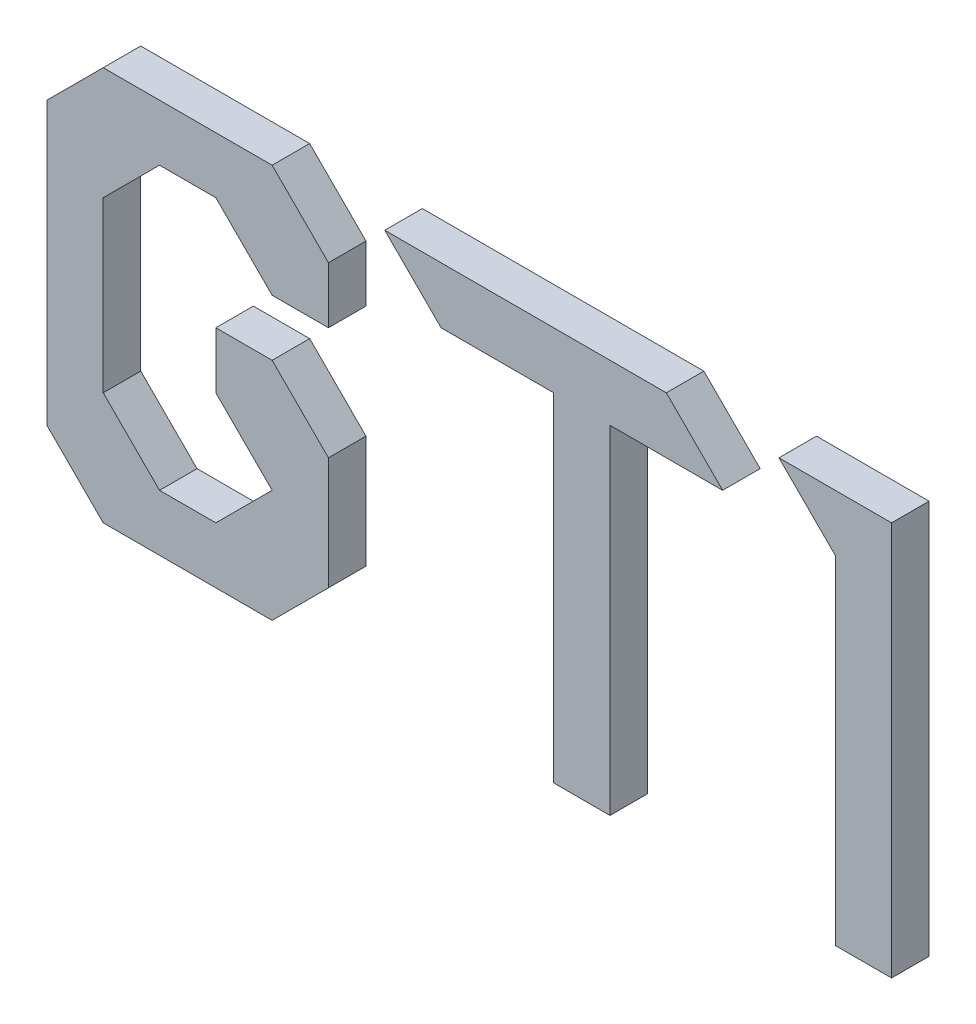
ISO-10303-21;
HEADER;
FILE_DESCRIPTION(('STEP AP214'),'2;1');
FILE_NAME('part.step','',(''),(''),'','','');
FILE_SCHEMA(('AUTOMOTIVE_DESIGN { 1 0 10303 214 1 1 1 1 }'));
ENDSEC;
DATA;
#1=APPLICATION_CONTEXT('core data for automotive mechanical design processes');
#2=APPLICATION_PROTOCOL_DEFINITION('international standard','automotive_design',2000,#1);
#3=PRODUCT_CONTEXT('',#1,'mechanical');
#4=PRODUCT('Part','Part','',(#3));
#5=PRODUCT_RELATED_PRODUCT_CATEGORY('part','',(#4));
#6=PRODUCT_DEFINITION_FORMATION('','',#4);
#7=PRODUCT_DEFINITION_CONTEXT('part definition',#1,'design');
#8=PRODUCT_DEFINITION('design','',#6,#7);
#9=PRODUCT_DEFINITION_SHAPE('','',#8);
#10=(LENGTH_UNIT() NAMED_UNIT(*) SI_UNIT(.MILLI.,.METRE.));
#11=(NAMED_UNIT(*) PLANE_ANGLE_UNIT() SI_UNIT($,.RADIAN.));
#12=(NAMED_UNIT(*) SI_UNIT($,.STERADIAN.) SOLID_ANGLE_UNIT());
#13=UNCERTAINTY_MEASURE_WITH_UNIT(LENGTH_MEASURE(1.E-05),#10,'distance_accuracy_value','');
#14=(GEOMETRIC_REPRESENTATION_CONTEXT(3) GLOBAL_UNCERTAINTY_ASSIGNED_CONTEXT((#13)) GLOBAL_UNIT_ASSIGNED_CONTEXT((#10,
#11,#12)) REPRESENTATION_CONTEXT('',''));
#15=CARTESIAN_POINT('',(0.,0.,0.));
#16=DIRECTION('',(0.,0.,1.));
#17=DIRECTION('',(1.,0.,0.));
#18=AXIS2_PLACEMENT_3D('',#15,#16,#17);
#19=CARTESIAN_POINT('',(112.5,90.,10.));
#20=DIRECTION('',(0.,-1.,0.));
#21=DIRECTION('',(0.,0.,-1.));
#22=AXIS2_PLACEMENT_3D('',#19,#20,#21);
#23=PLANE('',#22);
#24=DIRECTION('',(-1.,0.,0.));
#25=VECTOR('',#24,1.);
#26=CARTESIAN_POINT('',(112.5,90.,0.));
#27=LINE('',#26,#25);
#28=CARTESIAN_POINT('',(180.,90.,0.));
#29=VERTEX_POINT('',#28);
#30=CARTESIAN_POINT('',(150.,90.,0.));
#31=VERTEX_POINT('',#30);
#32=EDGE_CURVE('E137',#29,#31,#27,.T.);
#33=ORIENTED_EDGE('',*,*,#32,.F.);
#34=DIRECTION('',(0.,0.,-1.));
#35=VECTOR('',#34,1.);
#36=CARTESIAN_POINT('',(180.,90.,10.));
#37=LINE('',#36,#35);
#38=CARTESIAN_POINT('',(180.,90.,10.));
#39=VERTEX_POINT('',#38);
#40=EDGE_CURVE('E12',#39,#29,#37,.T.);
#41=ORIENTED_EDGE('',*,*,#40,.F.);
#42=DIRECTION('',(-1.,0.,0.));
#43=VECTOR('',#42,1.);
#44=CARTESIAN_POINT('',(112.5,90.,10.));
#45=LINE('',#44,#43);
#46=CARTESIAN_POINT('',(150.,90.,10.));
#47=VERTEX_POINT('',#46);
#48=EDGE_CURVE('E155',#39,#47,#45,.T.);
#49=ORIENTED_EDGE('',*,*,#48,.T.);
#50=DIRECTION('',(0.,0.,-1.));
#51=VECTOR('',#50,1.);
#52=CARTESIAN_POINT('',(150.,90.,10.));
#53=LINE('',#52,#51);
#54=EDGE_CURVE('E61',#47,#31,#53,.T.);
#55=ORIENTED_EDGE('',*,*,#54,.T.);
#56=EDGE_LOOP('',(#33,#41,#49,#55));
#57=FACE_BOUND('',#56,.T.);
#58=ADVANCED_FACE('F44',(#57),#23,.T.);
#59=CARTESIAN_POINT('',(261.634484941555,8.36551505844435,10.));
#60=DIRECTION('',(0.707106781186547,0.707106781186548,0.));
#61=DIRECTION('',(-0.707106781186548,0.707106781186547,0.));
#62=AXIS2_PLACEMENT_3D('',#59,#60,#61);
#63=PLANE('',#62);
#64=DIRECTION('',(0.707106781186548,-0.707106781186547,0.));
#65=VECTOR('',#64,1.);
#66=CARTESIAN_POINT('',(261.634484941555,8.36551505844435,0.));
#67=LINE('',#66,#65);
#68=CARTESIAN_POINT('',(165.,105.,0.));
#69=VERTEX_POINT('',#68);
#70=EDGE_CURVE('E139',#69,#29,#67,.T.);
#71=ORIENTED_EDGE('',*,*,#70,.F.);
#72=DIRECTION('',(0.,0.,-1.));
#73=VECTOR('',#72,1.);
#74=CARTESIAN_POINT('',(165.,105.,10.));
#75=LINE('',#74,#73);
#76=CARTESIAN_POINT('',(165.,105.,10.));
#77=VERTEX_POINT('',#76);
#78=EDGE_CURVE('E53',#77,#69,#75,.T.);
#79=ORIENTED_EDGE('',*,*,#78,.F.);
#80=DIRECTION('',(0.707106781186548,-0.707106781186547,0.));
#81=VECTOR('',#80,1.);
#82=CARTESIAN_POINT('',(261.634484941555,8.36551505844435,10.));
#83=LINE('',#82,#81);
#84=EDGE_CURVE('E182',#77,#39,#83,.T.);
#85=ORIENTED_EDGE('',*,*,#84,.T.);
#86=ORIENTED_EDGE('',*,*,#40,.T.);
#87=EDGE_LOOP('',(#71,#79,#85,#86));
#88=FACE_BOUND('',#87,.T.);
#89=ADVANCED_FACE('F46',(#88),#63,.T.);
#90=CARTESIAN_POINT('',(112.5,105.,10.));
#91=DIRECTION('',(0.,1.,0.));
#92=DIRECTION('',(0.,0.,1.));
#93=AXIS2_PLACEMENT_3D('',#90,#91,#92);
#94=PLANE('',#93);
#95=DIRECTION('',(1.,0.,0.));
#96=VECTOR('',#95,1.);
#97=CARTESIAN_POINT('',(112.5,105.,0.));
#98=LINE('',#97,#96);
#99=CARTESIAN_POINT('',(89.9999999999997,105.,0.));
#100=VERTEX_POINT('',#99);
#101=EDGE_CURVE('E143',#100,#69,#98,.T.);
#102=ORIENTED_EDGE('',*,*,#101,.F.);
#103=DIRECTION('',(0.,0.,-1.));
#104=VECTOR('',#103,1.);
#105=CARTESIAN_POINT('',(89.9999999999997,105.,10.));
#106=LINE('',#105,#104);
#107=CARTESIAN_POINT('',(89.9999999999997,105.,10.));
#108=VERTEX_POINT('',#107);
#109=EDGE_CURVE('E161',#108,#100,#106,.T.);
#110=ORIENTED_EDGE('',*,*,#109,.F.);
#111=DIRECTION('',(1.,0.,0.));
#112=VECTOR('',#111,1.);
#113=CARTESIAN_POINT('',(112.5,105.,10.));
#114=LINE('',#113,#112);
#115=EDGE_CURVE('E168',#108,#77,#114,.T.);
#116=ORIENTED_EDGE('',*,*,#115,.T.);
#117=ORIENTED_EDGE('',*,*,#78,.T.);
#118=EDGE_LOOP('',(#102,#110,#116,#117));
#119=FACE_BOUND('',#118,.T.);
#120=ADVANCED_FACE('F166',(#119),#94,.T.);
#121=CARTESIAN_POINT('',(224.134484941555,-29.1344849415553,10.));
#122=DIRECTION('',(0.707106781186546,0.707106781186549,0.));
#123=DIRECTION('',(-0.707106781186549,0.707106781186546,0.));
#124=AXIS2_PLACEMENT_3D('',#121,#122,#123);
#125=PLANE('',#124);
#126=DIRECTION('',(0.707106781186549,-0.707106781186546,0.));
#127=VECTOR('',#126,1.);
#128=CARTESIAN_POINT('',(224.134484941555,-29.1344849415553,0.));
#129=LINE('',#128,#127);
#130=CARTESIAN_POINT('',(105.,90.,0.));
#131=VERTEX_POINT('',#130);
#132=EDGE_CURVE('E146',#100,#131,#129,.T.);
#133=ORIENTED_EDGE('',*,*,#132,.T.);
#134=DIRECTION('',(0.,0.,-1.));
#135=VECTOR('',#134,1.);
#136=CARTESIAN_POINT('',(105.,90.,10.));
#137=LINE('',#136,#135);
#138=CARTESIAN_POINT('',(105.,90.,10.));
#139=VERTEX_POINT('',#138);
#140=EDGE_CURVE('E159',#139,#131,#137,.T.);
#141=ORIENTED_EDGE('',*,*,#140,.F.);
#142=DIRECTION('',(0.707106781186549,-0.707106781186546,0.));
#143=VECTOR('',#142,1.);
#144=CARTESIAN_POINT('',(224.134484941555,-29.1344849415553,10.));
#145=LINE('',#144,#143);
#146=EDGE_CURVE('E181',#108,#139,#145,.T.);
#147=ORIENTED_EDGE('',*,*,#146,.F.);
#148=ORIENTED_EDGE('',*,*,#109,.T.);
#149=EDGE_LOOP('',(#133,#141,#147,#148));
#150=FACE_BOUND('',#149,.T.);
#151=ADVANCED_FACE('F179',(#150),#125,.F.);
#152=CARTESIAN_POINT('',(135.,90.,0.));
#153=VERTEX_POINT('',#152);
#154=EDGE_CURVE('E140',#153,#131,#27,.T.);
#155=ORIENTED_EDGE('',*,*,#154,.F.);
#156=DIRECTION('',(0.,0.,-1.));
#157=VECTOR('',#156,1.);
#158=CARTESIAN_POINT('',(135.,90.,10.));
#159=LINE('',#158,#157);
#160=CARTESIAN_POINT('',(135.,90.,10.));
#161=VERTEX_POINT('',#160);
#162=EDGE_CURVE('E120',#161,#153,#159,.T.);
#163=ORIENTED_EDGE('',*,*,#162,.F.);
#164=EDGE_CURVE('E129',#161,#139,#45,.T.);
#165=ORIENTED_EDGE('',*,*,#164,.T.);
#166=ORIENTED_EDGE('',*,*,#140,.T.);
#167=EDGE_LOOP('',(#155,#163,#165,#166));
#168=FACE_BOUND('',#167,.T.);
#169=ADVANCED_FACE('F187',(#168),#23,.T.);
#170=CARTESIAN_POINT('',(135.,-140.768969883111,10.));
#171=DIRECTION('',(-1.,0.,0.));
#172=DIRECTION('',(0.,-1.,0.));
#173=AXIS2_PLACEMENT_3D('',#170,#171,#172);
#174=PLANE('',#173);
#175=DIRECTION('',(0.,1.,0.));
#176=VECTOR('',#175,1.);
#177=CARTESIAN_POINT('',(135.,-140.768969883111,0.));
#178=LINE('',#177,#176);
#179=CARTESIAN_POINT('',(135.,0.,0.));
#180=VERTEX_POINT('',#179);
#181=EDGE_CURVE('E116',#180,#153,#178,.T.);
#182=ORIENTED_EDGE('',*,*,#181,.F.);
#183=DIRECTION('',(0.,0.,-1.));
#184=VECTOR('',#183,1.);
#185=CARTESIAN_POINT('',(135.,0.,10.));
#186=LINE('',#185,#184);
#187=CARTESIAN_POINT('',(135.,0.,10.));
#188=VERTEX_POINT('',#187);
#189=EDGE_CURVE('E111',#188,#180,#186,.T.);
#190=ORIENTED_EDGE('',*,*,#189,.F.);
#191=DIRECTION('',(0.,1.,0.));
#192=VECTOR('',#191,1.);
#193=CARTESIAN_POINT('',(135.,-140.768969883111,10.));
#194=LINE('',#193,#192);
#195=EDGE_CURVE('E114',#188,#161,#194,.T.);
#196=ORIENTED_EDGE('',*,*,#195,.T.);
#197=ORIENTED_EDGE('',*,*,#162,.T.);
#198=EDGE_LOOP('',(#182,#190,#196,#197));
#199=FACE_BOUND('',#198,.T.);
#200=ADVANCED_FACE('F113',(#199),#174,.T.);
#201=CARTESIAN_POINT('',(112.5,0.,10.));
#202=DIRECTION('',(0.,-1.,0.));
#203=DIRECTION('',(0.,0.,-1.));
#204=AXIS2_PLACEMENT_3D('',#201,#202,#203);
#205=PLANE('',#204);
#206=DIRECTION('',(-1.,0.,0.));
#207=VECTOR('',#206,1.);
#208=CARTESIAN_POINT('',(112.5,0.,0.));
#209=LINE('',#208,#207);
#210=CARTESIAN_POINT('',(150.,0.,0.));
#211=VERTEX_POINT('',#210);
#212=EDGE_CURVE('E150',#211,#180,#209,.T.);
#213=ORIENTED_EDGE('',*,*,#212,.F.);
#214=DIRECTION('',(0.,0.,-1.));
#215=VECTOR('',#214,1.);
#216=CARTESIAN_POINT('',(150.,0.,10.));
#217=LINE('',#216,#215);
#218=CARTESIAN_POINT('',(150.,0.,10.));
#219=VERTEX_POINT('',#218);
#220=EDGE_CURVE('E86',#219,#211,#217,.T.);
#221=ORIENTED_EDGE('',*,*,#220,.F.);
#222=DIRECTION('',(-1.,0.,0.));
#223=VECTOR('',#222,1.);
#224=CARTESIAN_POINT('',(112.5,0.,10.));
#225=LINE('',#224,#223);
#226=EDGE_CURVE('E127',#219,#188,#225,.T.);
#227=ORIENTED_EDGE('',*,*,#226,.T.);
#228=ORIENTED_EDGE('',*,*,#189,.T.);
#229=EDGE_LOOP('',(#213,#221,#227,#228));
#230=FACE_BOUND('',#229,.T.);
#231=ADVANCED_FACE('F131',(#230),#205,.T.);
#232=CARTESIAN_POINT('',(150.,-140.768969883111,10.));
#233=DIRECTION('',(1.,0.,0.));
#234=DIRECTION('',(0.,1.,0.));
#235=AXIS2_PLACEMENT_3D('',#232,#233,#234);
#236=PLANE('',#235);
#237=DIRECTION('',(0.,-1.,0.));
#238=VECTOR('',#237,1.);
#239=CARTESIAN_POINT('',(150.,-140.768969883111,0.));
#240=LINE('',#239,#238);
#241=EDGE_CURVE('E152',#31,#211,#240,.T.);
#242=ORIENTED_EDGE('',*,*,#241,.F.);
#243=ORIENTED_EDGE('',*,*,#54,.F.);
#244=DIRECTION('',(0.,-1.,0.));
#245=VECTOR('',#244,1.);
#246=CARTESIAN_POINT('',(150.,-140.768969883111,10.));
#247=LINE('',#246,#245);
#248=EDGE_CURVE('E132',#47,#219,#247,.T.);
#249=ORIENTED_EDGE('',*,*,#248,.T.);
#250=ORIENTED_EDGE('',*,*,#220,.T.);
#251=EDGE_LOOP('',(#242,#243,#249,#250));
#252=FACE_BOUND('',#251,.T.);
#253=ADVANCED_FACE('F188',(#252),#236,.T.);
#254=CARTESIAN_POINT('',(112.5,-140.768969883111,10.));
#255=DIRECTION('',(0.,0.,1.));
#256=DIRECTION('',(1.,0.,0.));
#257=AXIS2_PLACEMENT_3D('',#254,#255,#256);
#258=PLANE('',#257);
#259=ORIENTED_EDGE('',*,*,#48,.F.);
#260=ORIENTED_EDGE('',*,*,#84,.F.);
#261=ORIENTED_EDGE('',*,*,#115,.F.);
#262=ORIENTED_EDGE('',*,*,#146,.T.);
#263=ORIENTED_EDGE('',*,*,#164,.F.);
#264=ORIENTED_EDGE('',*,*,#195,.F.);
#265=ORIENTED_EDGE('',*,*,#226,.F.);
#266=ORIENTED_EDGE('',*,*,#248,.F.);
#267=EDGE_LOOP('',(#259,#260,#261,#262,#263,#264,#265,#266));
#268=FACE_BOUND('',#267,.T.);
#269=ADVANCED_FACE('F125',(#268),#258,.T.);
#270=CARTESIAN_POINT('',(112.5,-140.768969883111,0.));
#271=DIRECTION('',(0.,0.,1.));
#272=DIRECTION('',(1.,0.,0.));
#273=AXIS2_PLACEMENT_3D('',#270,#271,#272);
#274=PLANE('',#273);
#275=ORIENTED_EDGE('',*,*,#32,.T.);
#276=ORIENTED_EDGE('',*,*,#241,.T.);
#277=ORIENTED_EDGE('',*,*,#212,.T.);
#278=ORIENTED_EDGE('',*,*,#181,.T.);
#279=ORIENTED_EDGE('',*,*,#154,.T.);
#280=ORIENTED_EDGE('',*,*,#132,.F.);
#281=ORIENTED_EDGE('',*,*,#101,.T.);
#282=ORIENTED_EDGE('',*,*,#70,.T.);
#283=EDGE_LOOP('',(#275,#276,#277,#278,#279,#280,#281,#282));
#284=FACE_BOUND('',#283,.T.);
#285=ADVANCED_FACE('F174',(#284),#274,.F.);
#286=CLOSED_SHELL('',(#58,#89,#120,#151,#169,#200,#231,#253,#269,#285));
#287=MANIFOLD_SOLID_BREP('B2',#286);
#288=CARTESIAN_POINT('',(225.,-140.768969883111,10.));
#289=DIRECTION('',(-1.,0.,0.));
#290=DIRECTION('',(0.,-1.,0.));
#291=AXIS2_PLACEMENT_3D('',#288,#289,#290);
#292=PLANE('',#291);
#293=DIRECTION('',(0.,1.,0.));
#294=VECTOR('',#293,1.);
#295=CARTESIAN_POINT('',(225.,-140.768969883111,0.));
#296=LINE('',#295,#294);
#297=CARTESIAN_POINT('',(225.,0.,0.));
#298=VERTEX_POINT('',#297);
#299=CARTESIAN_POINT('',(225.,105.,0.));
#300=VERTEX_POINT('',#299);
#301=EDGE_CURVE('E379',#298,#300,#296,.T.);
#302=ORIENTED_EDGE('',*,*,#301,.T.);
#303=DIRECTION('',(0.,0.,-1.));
#304=VECTOR('',#303,1.);
#305=CARTESIAN_POINT('',(225.,105.,10.));
#306=LINE('',#305,#304);
#307=CARTESIAN_POINT('',(225.,105.,10.));
#308=VERTEX_POINT('',#307);
#309=EDGE_CURVE('E42',#308,#300,#306,.T.);
#310=ORIENTED_EDGE('',*,*,#309,.F.);
#311=DIRECTION('',(0.,1.,0.));
#312=VECTOR('',#311,1.);
#313=CARTESIAN_POINT('',(225.,-140.768969883111,10.));
#314=LINE('',#313,#312);
#315=CARTESIAN_POINT('',(225.,0.,10.));
#316=VERTEX_POINT('',#315);
#317=EDGE_CURVE('E387',#316,#308,#314,.T.);
#318=ORIENTED_EDGE('',*,*,#317,.F.);
#319=DIRECTION('',(0.,0.,-1.));
#320=VECTOR('',#319,1.);
#321=CARTESIAN_POINT('',(225.,0.,10.));
#322=LINE('',#321,#320);
#323=EDGE_CURVE('E375',#316,#298,#322,.T.);
#324=ORIENTED_EDGE('',*,*,#323,.T.);
#325=EDGE_LOOP('',(#302,#310,#318,#324));
#326=FACE_BOUND('',#325,.T.);
#327=ADVANCED_FACE('F305',(#326),#292,.F.);
#328=CARTESIAN_POINT('',(112.5,105.,10.));
#329=DIRECTION('',(0.,-1.,0.));
#330=DIRECTION('',(0.,0.,-1.));
#331=AXIS2_PLACEMENT_3D('',#328,#329,#330);
#332=PLANE('',#331);
#333=DIRECTION('',(-1.,0.,0.));
#334=VECTOR('',#333,1.);
#335=CARTESIAN_POINT('',(112.5,105.,0.));
#336=LINE('',#335,#334);
#337=CARTESIAN_POINT('',(195.,105.,0.));
#338=VERTEX_POINT('',#337);
#339=EDGE_CURVE('E382',#300,#338,#336,.T.);
#340=ORIENTED_EDGE('',*,*,#339,.T.);
#341=DIRECTION('',(0.,0.,-1.));
#342=VECTOR('',#341,1.);
#343=CARTESIAN_POINT('',(195.,105.,10.));
#344=LINE('',#343,#342);
#345=CARTESIAN_POINT('',(195.,105.,10.));
#346=VERTEX_POINT('',#345);
#347=EDGE_CURVE('E313',#346,#338,#344,.T.);
#348=ORIENTED_EDGE('',*,*,#347,.F.);
#349=DIRECTION('',(-1.,0.,0.));
#350=VECTOR('',#349,1.);
#351=CARTESIAN_POINT('',(112.5,105.,10.));
#352=LINE('',#351,#350);
#353=EDGE_CURVE('E355',#308,#346,#352,.T.);
#354=ORIENTED_EDGE('',*,*,#353,.F.);
#355=ORIENTED_EDGE('',*,*,#309,.T.);
#356=EDGE_LOOP('',(#340,#348,#354,#355));
#357=FACE_BOUND('',#356,.T.);
#358=ADVANCED_FACE('F406',(#357),#332,.F.);
#359=CARTESIAN_POINT('',(276.634484941555,23.3655150584448,10.));
#360=DIRECTION('',(0.707106781186546,0.707106781186549,0.));
#361=DIRECTION('',(-0.707106781186549,0.707106781186546,0.));
#362=AXIS2_PLACEMENT_3D('',#359,#360,#361);
#363=PLANE('',#362);
#364=DIRECTION('',(0.707106781186549,-0.707106781186546,0.));
#365=VECTOR('',#364,1.);
#366=CARTESIAN_POINT('',(276.634484941555,23.3655150584448,0.));
#367=LINE('',#366,#365);
#368=CARTESIAN_POINT('',(210.,90.,0.));
#369=VERTEX_POINT('',#368);
#370=EDGE_CURVE('E370',#338,#369,#367,.T.);
#371=ORIENTED_EDGE('',*,*,#370,.T.);
#372=DIRECTION('',(0.,0.,-1.));
#373=VECTOR('',#372,1.);
#374=CARTESIAN_POINT('',(210.,90.,10.));
#375=LINE('',#374,#373);
#376=CARTESIAN_POINT('',(210.,90.,10.));
#377=VERTEX_POINT('',#376);
#378=EDGE_CURVE('E367',#377,#369,#375,.T.);
#379=ORIENTED_EDGE('',*,*,#378,.F.);
#380=DIRECTION('',(0.707106781186549,-0.707106781186546,0.));
#381=VECTOR('',#380,1.);
#382=CARTESIAN_POINT('',(276.634484941555,23.3655150584448,10.));
#383=LINE('',#382,#381);
#384=EDGE_CURVE('E359',#346,#377,#383,.T.);
#385=ORIENTED_EDGE('',*,*,#384,.F.);
#386=ORIENTED_EDGE('',*,*,#347,.T.);
#387=EDGE_LOOP('',(#371,#379,#385,#386));
#388=FACE_BOUND('',#387,.T.);
#389=ADVANCED_FACE('F368',(#388),#363,.F.);
#390=CARTESIAN_POINT('',(210.,-140.768969883111,10.));
#391=DIRECTION('',(1.,0.,0.));
#392=DIRECTION('',(0.,1.,0.));
#393=AXIS2_PLACEMENT_3D('',#390,#391,#392);
#394=PLANE('',#393);
#395=DIRECTION('',(0.,-1.,0.));
#396=VECTOR('',#395,1.);
#397=CARTESIAN_POINT('',(210.,-140.768969883111,0.));
#398=LINE('',#397,#396);
#399=CARTESIAN_POINT('',(210.,0.,0.));
#400=VERTEX_POINT('',#399);
#401=EDGE_CURVE('E341',#369,#400,#398,.T.);
#402=ORIENTED_EDGE('',*,*,#401,.T.);
#403=DIRECTION('',(0.,0.,-1.));
#404=VECTOR('',#403,1.);
#405=CARTESIAN_POINT('',(210.,0.,10.));
#406=LINE('',#405,#404);
#407=CARTESIAN_POINT('',(210.,0.,10.));
#408=VERTEX_POINT('',#407);
#409=EDGE_CURVE('E371',#408,#400,#406,.T.);
#410=ORIENTED_EDGE('',*,*,#409,.F.);
#411=DIRECTION('',(0.,-1.,0.));
#412=VECTOR('',#411,1.);
#413=CARTESIAN_POINT('',(210.,-140.768969883111,10.));
#414=LINE('',#413,#412);
#415=EDGE_CURVE('E363',#377,#408,#414,.T.);
#416=ORIENTED_EDGE('',*,*,#415,.F.);
#417=ORIENTED_EDGE('',*,*,#378,.T.);
#418=EDGE_LOOP('',(#402,#410,#416,#417));
#419=FACE_BOUND('',#418,.T.);
#420=ADVANCED_FACE('F373',(#419),#394,.F.);
#421=CARTESIAN_POINT('',(112.5,0.,10.));
#422=DIRECTION('',(0.,1.,0.));
#423=DIRECTION('',(0.,0.,1.));
#424=AXIS2_PLACEMENT_3D('',#421,#422,#423);
#425=PLANE('',#424);
#426=DIRECTION('',(1.,0.,0.));
#427=VECTOR('',#426,1.);
#428=CARTESIAN_POINT('',(112.5,0.,0.));
#429=LINE('',#428,#427);
#430=EDGE_CURVE('E347',#400,#298,#429,.T.);
#431=ORIENTED_EDGE('',*,*,#430,.T.);
#432=ORIENTED_EDGE('',*,*,#323,.F.);
#433=DIRECTION('',(1.,0.,0.));
#434=VECTOR('',#433,1.);
#435=CARTESIAN_POINT('',(112.5,0.,10.));
#436=LINE('',#435,#434);
#437=EDGE_CURVE('E321',#408,#316,#436,.T.);
#438=ORIENTED_EDGE('',*,*,#437,.F.);
#439=ORIENTED_EDGE('',*,*,#409,.T.);
#440=EDGE_LOOP('',(#431,#432,#438,#439));
#441=FACE_BOUND('',#440,.T.);
#442=ADVANCED_FACE('F395',(#441),#425,.F.);
#443=CARTESIAN_POINT('',(112.5,-140.768969883111,10.));
#444=DIRECTION('',(0.,0.,1.));
#445=DIRECTION('',(1.,0.,0.));
#446=AXIS2_PLACEMENT_3D('',#443,#444,#445);
#447=PLANE('',#446);
#448=ORIENTED_EDGE('',*,*,#317,.T.);
#449=ORIENTED_EDGE('',*,*,#353,.T.);
#450=ORIENTED_EDGE('',*,*,#384,.T.);
#451=ORIENTED_EDGE('',*,*,#415,.T.);
#452=ORIENTED_EDGE('',*,*,#437,.T.);
#453=EDGE_LOOP('',(#448,#449,#450,#451,#452));
#454=FACE_BOUND('',#453,.T.);
#455=ADVANCED_FACE('F361',(#454),#447,.T.);
#456=CARTESIAN_POINT('',(112.5,-140.768969883111,0.));
#457=DIRECTION('',(0.,0.,1.));
#458=DIRECTION('',(1.,0.,0.));
#459=AXIS2_PLACEMENT_3D('',#456,#457,#458);
#460=PLANE('',#459);
#461=ORIENTED_EDGE('',*,*,#301,.F.);
#462=ORIENTED_EDGE('',*,*,#430,.F.);
#463=ORIENTED_EDGE('',*,*,#401,.F.);
#464=ORIENTED_EDGE('',*,*,#370,.F.);
#465=ORIENTED_EDGE('',*,*,#339,.F.);
#466=EDGE_LOOP('',(#461,#462,#463,#464,#465));
#467=FACE_BOUND('',#466,.T.);
#468=ADVANCED_FACE('F391',(#467),#460,.F.);
#469=CLOSED_SHELL('',(#327,#358,#389,#420,#442,#455,#468));
#470=MANIFOLD_SOLID_BREP('B6',#469);
#471=CARTESIAN_POINT('',(15.8655150584443,-44.1344849415557,10.));
#472=DIRECTION('',(0.707106781186548,-0.707106781186548,0.));
#473=DIRECTION('',(0.707106781186548,0.707106781186548,0.));
#474=AXIS2_PLACEMENT_3D('',#471,#472,#473);
#475=PLANE('',#474);
#476=DIRECTION('',(-0.707106781186548,-0.707106781186548,0.));
#477=VECTOR('',#476,1.);
#478=CARTESIAN_POINT('',(15.8655150584443,-44.1344849415557,0.));
#479=LINE('',#478,#477);
#480=CARTESIAN_POINT('',(75.,15.,0.));
#481=VERTEX_POINT('',#480);
#482=CARTESIAN_POINT('',(60.,0.,0.));
#483=VERTEX_POINT('',#482);
#484=EDGE_CURVE('E626',#481,#483,#479,.T.);
#485=ORIENTED_EDGE('',*,*,#484,.F.);
#486=DIRECTION('',(0.,0.,-1.));
#487=VECTOR('',#486,1.);
#488=CARTESIAN_POINT('',(75.,15.,10.));
#489=LINE('',#488,#487);
#490=CARTESIAN_POINT('',(75.,15.,10.));
#491=VERTEX_POINT('',#490);
#492=EDGE_CURVE('E303',#491,#481,#489,.T.);
#493=ORIENTED_EDGE('',*,*,#492,.F.);
#494=DIRECTION('',(-0.707106781186548,-0.707106781186548,0.));
#495=VECTOR('',#494,1.);
#496=CARTESIAN_POINT('',(15.8655150584443,-44.1344849415557,10.));
#497=LINE('',#496,#495);
#498=CARTESIAN_POINT('',(60.,0.,10.));
#499=VERTEX_POINT('',#498);
#500=EDGE_CURVE('E685',#491,#499,#497,.T.);
#501=ORIENTED_EDGE('',*,*,#500,.T.);
#502=DIRECTION('',(0.,0.,-1.));
#503=VECTOR('',#502,1.);
#504=CARTESIAN_POINT('',(60.,0.,10.));
#505=LINE('',#504,#503);
#506=EDGE_CURVE('E471',#499,#483,#505,.T.);
#507=ORIENTED_EDGE('',*,*,#506,.T.);
#508=EDGE_LOOP('',(#485,#493,#501,#507));
#509=FACE_BOUND('',#508,.T.);
#510=ADVANCED_FACE('F455',(#509),#475,.T.);
#511=CARTESIAN_POINT('',(75.0000000000005,-140.768969883111,10.));
#512=DIRECTION('',(1.,0.,0.));
#513=DIRECTION('',(0.,1.,0.));
#514=AXIS2_PLACEMENT_3D('',#511,#512,#513);
#515=PLANE('',#514);
#516=DIRECTION('',(0.,-1.,0.));
#517=VECTOR('',#516,1.);
#518=CARTESIAN_POINT('',(75.0000000000005,-140.768969883111,0.));
#519=LINE('',#518,#517);
#520=CARTESIAN_POINT('',(74.9999999999999,45.,0.));
#521=VERTEX_POINT('',#520);
#522=EDGE_CURVE('E628',#521,#481,#519,.T.);
#523=ORIENTED_EDGE('',*,*,#522,.F.);
#524=DIRECTION('',(0.,0.,-1.));
#525=VECTOR('',#524,1.);
#526=CARTESIAN_POINT('',(74.9999999999999,45.,10.));
#527=LINE('',#526,#525);
#528=CARTESIAN_POINT('',(74.9999999999999,45.,10.));
#529=VERTEX_POINT('',#528);
#530=EDGE_CURVE('E463',#529,#521,#527,.T.);
#531=ORIENTED_EDGE('',*,*,#530,.F.);
#532=DIRECTION('',(0.,-1.,0.));
#533=VECTOR('',#532,1.);
#534=CARTESIAN_POINT('',(75.0000000000005,-140.768969883111,10.));
#535=LINE('',#534,#533);
#536=EDGE_CURVE('E740',#529,#491,#535,.T.);
#537=ORIENTED_EDGE('',*,*,#536,.T.);
#538=ORIENTED_EDGE('',*,*,#492,.T.);
#539=EDGE_LOOP('',(#523,#531,#537,#538));
#540=FACE_BOUND('',#539,.T.);
#541=ADVANCED_FACE('F728',(#540),#515,.T.);
#542=CARTESIAN_POINT('',(186.634484941556,-66.6344849415552,10.));
#543=DIRECTION('',(0.707106781186546,0.707106781186549,0.));
#544=DIRECTION('',(-0.707106781186549,0.707106781186546,0.));
#545=AXIS2_PLACEMENT_3D('',#542,#543,#544);
#546=PLANE('',#545);
#547=DIRECTION('',(0.707106781186549,-0.707106781186546,0.));
#548=VECTOR('',#547,1.);
#549=CARTESIAN_POINT('',(186.634484941556,-66.6344849415552,0.));
#550=LINE('',#549,#548);
#551=CARTESIAN_POINT('',(59.9999999999998,60.,0.));
#552=VERTEX_POINT('',#551);
#553=EDGE_CURVE('E631',#552,#521,#550,.T.);
#554=ORIENTED_EDGE('',*,*,#553,.F.);
#555=DIRECTION('',(0.,0.,-1.));
#556=VECTOR('',#555,1.);
#557=CARTESIAN_POINT('',(59.9999999999998,60.,10.));
#558=LINE('',#557,#556);
#559=CARTESIAN_POINT('',(59.9999999999998,60.,10.));
#560=VERTEX_POINT('',#559);
#561=EDGE_CURVE('E717',#560,#552,#558,.T.);
#562=ORIENTED_EDGE('',*,*,#561,.F.);
#563=DIRECTION('',(0.707106781186549,-0.707106781186546,0.));
#564=VECTOR('',#563,1.);
#565=CARTESIAN_POINT('',(186.634484941556,-66.6344849415552,10.));
#566=LINE('',#565,#564);
#567=EDGE_CURVE('E724',#560,#529,#566,.T.);
#568=ORIENTED_EDGE('',*,*,#567,.T.);
#569=ORIENTED_EDGE('',*,*,#530,.T.);
#570=EDGE_LOOP('',(#554,#562,#568,#569));
#571=FACE_BOUND('',#570,.T.);
#572=ADVANCED_FACE('F722',(#571),#546,.T.);
#573=CARTESIAN_POINT('',(112.5,60.,10.));
#574=DIRECTION('',(0.,1.,0.));
#575=DIRECTION('',(0.,0.,1.));
#576=AXIS2_PLACEMENT_3D('',#573,#574,#575);
#577=PLANE('',#576);
#578=DIRECTION('',(1.,0.,0.));
#579=VECTOR('',#578,1.);
#580=CARTESIAN_POINT('',(112.5,60.,0.));
#581=LINE('',#580,#579);
#582=CARTESIAN_POINT('',(44.9999999999998,60.,0.));
#583=VERTEX_POINT('',#582);
#584=EDGE_CURVE('E634',#583,#552,#581,.T.);
#585=ORIENTED_EDGE('',*,*,#584,.F.);
#586=DIRECTION('',(0.,0.,-1.));
#587=VECTOR('',#586,1.);
#588=CARTESIAN_POINT('',(44.9999999999998,60.,10.));
#589=LINE('',#588,#587);
#590=CARTESIAN_POINT('',(44.9999999999998,60.,10.));
#591=VERTEX_POINT('',#590);
#592=EDGE_CURVE('E715',#591,#583,#589,.T.);
#593=ORIENTED_EDGE('',*,*,#592,.F.);
#594=DIRECTION('',(1.,0.,0.));
#595=VECTOR('',#594,1.);
#596=CARTESIAN_POINT('',(112.5,60.,10.));
#597=LINE('',#596,#595);
#598=EDGE_CURVE('E737',#591,#560,#597,.T.);
#599=ORIENTED_EDGE('',*,*,#598,.T.);
#600=ORIENTED_EDGE('',*,*,#561,.T.);
#601=EDGE_LOOP('',(#585,#593,#599,#600));
#602=FACE_BOUND('',#601,.T.);
#603=ADVANCED_FACE('F734',(#602),#577,.T.);
#604=CARTESIAN_POINT('',(45.0000000000005,-140.768969883111,10.));
#605=DIRECTION('',(-1.,0.,0.));
#606=DIRECTION('',(0.,-1.,0.));
#607=AXIS2_PLACEMENT_3D('',#604,#605,#606);
#608=PLANE('',#607);
#609=DIRECTION('',(0.,1.,0.));
#610=VECTOR('',#609,1.);
#611=CARTESIAN_POINT('',(45.0000000000005,-140.768969883111,0.));
#612=LINE('',#611,#610);
#613=CARTESIAN_POINT('',(44.9999999999999,45.,0.));
#614=VERTEX_POINT('',#613);
#615=EDGE_CURVE('E637',#614,#583,#612,.T.);
#616=ORIENTED_EDGE('',*,*,#615,.F.);
#617=DIRECTION('',(0.,0.,-1.));
#618=VECTOR('',#617,1.);
#619=CARTESIAN_POINT('',(44.9999999999999,45.,10.));
#620=LINE('',#619,#618);
#621=CARTESIAN_POINT('',(44.9999999999999,45.,10.));
#622=VERTEX_POINT('',#621);
#623=EDGE_CURVE('E713',#622,#614,#620,.T.);
#624=ORIENTED_EDGE('',*,*,#623,.F.);
#625=DIRECTION('',(0.,1.,0.));
#626=VECTOR('',#625,1.);
#627=CARTESIAN_POINT('',(45.0000000000005,-140.768969883111,10.));
#628=LINE('',#627,#626);
#629=EDGE_CURVE('E742',#622,#591,#628,.T.);
#630=ORIENTED_EDGE('',*,*,#629,.T.);
#631=ORIENTED_EDGE('',*,*,#592,.T.);
#632=EDGE_LOOP('',(#616,#624,#630,#631));
#633=FACE_BOUND('',#632,.T.);
#634=ADVANCED_FACE('F808',(#633),#608,.T.);
#635=CARTESIAN_POINT('',(171.634484941556,-81.6344849415553,10.));
#636=DIRECTION('',(-0.707106781186546,-0.707106781186549,0.));
#637=DIRECTION('',(0.707106781186549,-0.707106781186546,0.));
#638=AXIS2_PLACEMENT_3D('',#635,#636,#637);
#639=PLANE('',#638);
#640=DIRECTION('',(-0.707106781186549,0.707106781186546,0.));
#641=VECTOR('',#640,1.);
#642=CARTESIAN_POINT('',(171.634484941556,-81.6344849415553,0.));
#643=LINE('',#642,#641);
#644=CARTESIAN_POINT('',(59.9999999999999,30.,0.));
#645=VERTEX_POINT('',#644);
#646=EDGE_CURVE('E640',#645,#614,#643,.T.);
#647=ORIENTED_EDGE('',*,*,#646,.F.);
#648=DIRECTION('',(0.,0.,-1.));
#649=VECTOR('',#648,1.);
#650=CARTESIAN_POINT('',(59.9999999999999,30.,10.));
#651=LINE('',#650,#649);
#652=CARTESIAN_POINT('',(59.9999999999999,30.,10.));
#653=VERTEX_POINT('',#652);
#654=EDGE_CURVE('E711',#653,#645,#651,.T.);
#655=ORIENTED_EDGE('',*,*,#654,.F.);
#656=DIRECTION('',(-0.707106781186549,0.707106781186546,0.));
#657=VECTOR('',#656,1.);
#658=CARTESIAN_POINT('',(171.634484941556,-81.6344849415553,10.));
#659=LINE('',#658,#657);
#660=EDGE_CURVE('E748',#653,#622,#659,.T.);
#661=ORIENTED_EDGE('',*,*,#660,.T.);
#662=ORIENTED_EDGE('',*,*,#623,.T.);
#663=EDGE_LOOP('',(#647,#655,#661,#662));
#664=FACE_BOUND('',#663,.T.);
#665=ADVANCED_FACE('F811',(#664),#639,.T.);
#666=CARTESIAN_POINT('',(0.865515058444163,-29.134484941556,10.));
#667=DIRECTION('',(-0.707106781186549,0.707106781186546,0.));
#668=DIRECTION('',(-0.707106781186546,-0.707106781186549,0.));
#669=AXIS2_PLACEMENT_3D('',#666,#667,#668);
#670=PLANE('',#669);
#671=DIRECTION('',(0.707106781186546,0.707106781186549,0.));
#672=VECTOR('',#671,1.);
#673=CARTESIAN_POINT('',(0.865515058444163,-29.134484941556,0.));
#674=LINE('',#673,#672);
#675=CARTESIAN_POINT('',(45.,15.,0.));
#676=VERTEX_POINT('',#675);
#677=EDGE_CURVE('E643',#676,#645,#674,.T.);
#678=ORIENTED_EDGE('',*,*,#677,.F.);
#679=DIRECTION('',(0.,0.,-1.));
#680=VECTOR('',#679,1.);
#681=CARTESIAN_POINT('',(45.,15.,10.));
#682=LINE('',#681,#680);
#683=CARTESIAN_POINT('',(45.,15.,10.));
#684=VERTEX_POINT('',#683);
#685=EDGE_CURVE('E709',#684,#676,#682,.T.);
#686=ORIENTED_EDGE('',*,*,#685,.F.);
#687=DIRECTION('',(0.707106781186546,0.707106781186549,0.));
#688=VECTOR('',#687,1.);
#689=CARTESIAN_POINT('',(0.865515058444163,-29.134484941556,10.));
#690=LINE('',#689,#688);
#691=EDGE_CURVE('E751',#684,#653,#690,.T.);
#692=ORIENTED_EDGE('',*,*,#691,.T.);
#693=ORIENTED_EDGE('',*,*,#654,.T.);
#694=EDGE_LOOP('',(#678,#686,#692,#693));
#695=FACE_BOUND('',#694,.T.);
#696=ADVANCED_FACE('F815',(#695),#670,.T.);
#697=CARTESIAN_POINT('',(112.5,15.,10.));
#698=DIRECTION('',(0.,1.,0.));
#699=DIRECTION('',(0.,0.,1.));
#700=AXIS2_PLACEMENT_3D('',#697,#698,#699);
#701=PLANE('',#700);
#702=DIRECTION('',(1.,0.,0.));
#703=VECTOR('',#702,1.);
#704=CARTESIAN_POINT('',(112.5,15.,0.));
#705=LINE('',#704,#703);
#706=CARTESIAN_POINT('',(30.,15.,0.));
#707=VERTEX_POINT('',#706);
#708=EDGE_CURVE('E646',#707,#676,#705,.T.);
#709=ORIENTED_EDGE('',*,*,#708,.F.);
#710=DIRECTION('',(0.,0.,-1.));
#711=VECTOR('',#710,1.);
#712=CARTESIAN_POINT('',(30.,15.,10.));
#713=LINE('',#712,#711);
#714=CARTESIAN_POINT('',(30.,15.,10.));
#715=VERTEX_POINT('',#714);
#716=EDGE_CURVE('E707',#715,#707,#713,.T.);
#717=ORIENTED_EDGE('',*,*,#716,.F.);
#718=DIRECTION('',(1.,0.,0.));
#719=VECTOR('',#718,1.);
#720=CARTESIAN_POINT('',(112.5,15.,10.));
#721=LINE('',#720,#719);
#722=EDGE_CURVE('E754',#715,#684,#721,.T.);
#723=ORIENTED_EDGE('',*,*,#722,.T.);
#724=ORIENTED_EDGE('',*,*,#685,.T.);
#725=EDGE_LOOP('',(#709,#717,#723,#724));
#726=FACE_BOUND('',#725,.T.);
#727=ADVANCED_FACE('F819',(#726),#701,.T.);
#728=CARTESIAN_POINT('',(149.134484941556,-104.134484941555,10.));
#729=DIRECTION('',(0.707106781186546,0.707106781186549,0.));
#730=DIRECTION('',(-0.707106781186549,0.707106781186546,0.));
#731=AXIS2_PLACEMENT_3D('',#728,#729,#730);
#732=PLANE('',#731);
#733=DIRECTION('',(0.707106781186549,-0.707106781186546,0.));
#734=VECTOR('',#733,1.);
#735=CARTESIAN_POINT('',(149.134484941556,-104.134484941555,0.));
#736=LINE('',#735,#734);
#737=CARTESIAN_POINT('',(15.,30.,0.));
#738=VERTEX_POINT('',#737);
#739=EDGE_CURVE('E649',#738,#707,#736,.T.);
#740=ORIENTED_EDGE('',*,*,#739,.F.);
#741=DIRECTION('',(0.,0.,-1.));
#742=VECTOR('',#741,1.);
#743=CARTESIAN_POINT('',(15.,30.,10.));
#744=LINE('',#743,#742);
#745=CARTESIAN_POINT('',(15.,30.,10.));
#746=VERTEX_POINT('',#745);
#747=EDGE_CURVE('E705',#746,#738,#744,.T.);
#748=ORIENTED_EDGE('',*,*,#747,.F.);
#749=DIRECTION('',(0.707106781186549,-0.707106781186546,0.));
#750=VECTOR('',#749,1.);
#751=CARTESIAN_POINT('',(149.134484941556,-104.134484941555,10.));
#752=LINE('',#751,#750);
#753=EDGE_CURVE('E757',#746,#715,#752,.T.);
#754=ORIENTED_EDGE('',*,*,#753,.T.);
#755=ORIENTED_EDGE('',*,*,#716,.T.);
#756=EDGE_LOOP('',(#740,#748,#754,#755));
#757=FACE_BOUND('',#756,.T.);
#758=ADVANCED_FACE('F823',(#757),#732,.T.);
#759=CARTESIAN_POINT('',(15.0000000000006,-140.768969883112,10.));
#760=DIRECTION('',(1.,0.,0.));
#761=DIRECTION('',(0.,1.,0.));
#762=AXIS2_PLACEMENT_3D('',#759,#760,#761);
#763=PLANE('',#762);
#764=DIRECTION('',(0.,-1.,0.));
#765=VECTOR('',#764,1.);
#766=CARTESIAN_POINT('',(15.0000000000006,-140.768969883112,0.));
#767=LINE('',#766,#765);
#768=CARTESIAN_POINT('',(14.9999999999998,75.,0.));
#769=VERTEX_POINT('',#768);
#770=EDGE_CURVE('E652',#769,#738,#767,.T.);
#771=ORIENTED_EDGE('',*,*,#770,.F.);
#772=DIRECTION('',(0.,0.,-1.));
#773=VECTOR('',#772,1.);
#774=CARTESIAN_POINT('',(14.9999999999998,75.,10.));
#775=LINE('',#774,#773);
#776=CARTESIAN_POINT('',(14.9999999999998,75.,10.));
#777=VERTEX_POINT('',#776);
#778=EDGE_CURVE('E703',#777,#769,#775,.T.);
#779=ORIENTED_EDGE('',*,*,#778,.F.);
#780=DIRECTION('',(0.,-1.,0.));
#781=VECTOR('',#780,1.);
#782=CARTESIAN_POINT('',(15.0000000000006,-140.768969883112,10.));
#783=LINE('',#782,#781);
#784=EDGE_CURVE('E760',#777,#746,#783,.T.);
#785=ORIENTED_EDGE('',*,*,#784,.T.);
#786=ORIENTED_EDGE('',*,*,#747,.T.);
#787=EDGE_LOOP('',(#771,#779,#785,#786));
#788=FACE_BOUND('',#787,.T.);
#789=ADVANCED_FACE('F827',(#788),#763,.T.);
#790=CARTESIAN_POINT('',(-44.134484941556,15.865515058444,10.));
#791=DIRECTION('',(0.707106781186549,-0.707106781186546,0.));
#792=DIRECTION('',(0.707106781186546,0.707106781186549,0.));
#793=AXIS2_PLACEMENT_3D('',#790,#791,#792);
#794=PLANE('',#793);
#795=DIRECTION('',(-0.707106781186546,-0.707106781186549,0.));
#796=VECTOR('',#795,1.);
#797=CARTESIAN_POINT('',(-44.134484941556,15.865515058444,0.));
#798=LINE('',#797,#796);
#799=CARTESIAN_POINT('',(29.9999999999997,90.,0.));
#800=VERTEX_POINT('',#799);
#801=EDGE_CURVE('E655',#800,#769,#798,.T.);
#802=ORIENTED_EDGE('',*,*,#801,.F.);
#803=DIRECTION('',(0.,0.,-1.));
#804=VECTOR('',#803,1.);
#805=CARTESIAN_POINT('',(29.9999999999997,90.,10.));
#806=LINE('',#805,#804);
#807=CARTESIAN_POINT('',(29.9999999999997,90.,10.));
#808=VERTEX_POINT('',#807);
#809=EDGE_CURVE('E701',#808,#800,#806,.T.);
#810=ORIENTED_EDGE('',*,*,#809,.F.);
#811=DIRECTION('',(-0.707106781186546,-0.707106781186549,0.));
#812=VECTOR('',#811,1.);
#813=CARTESIAN_POINT('',(-44.134484941556,15.865515058444,10.));
#814=LINE('',#813,#812);
#815=EDGE_CURVE('E763',#808,#777,#814,.T.);
#816=ORIENTED_EDGE('',*,*,#815,.T.);
#817=ORIENTED_EDGE('',*,*,#778,.T.);
#818=EDGE_LOOP('',(#802,#810,#816,#817));
#819=FACE_BOUND('',#818,.T.);
#820=ADVANCED_FACE('F831',(#819),#794,.T.);
#821=CARTESIAN_POINT('',(112.5,90.,10.));
#822=DIRECTION('',(0.,-1.,0.));
#823=DIRECTION('',(0.,0.,-1.));
#824=AXIS2_PLACEMENT_3D('',#821,#822,#823);
#825=PLANE('',#824);
#826=DIRECTION('',(-1.,0.,0.));
#827=VECTOR('',#826,1.);
#828=CARTESIAN_POINT('',(112.5,90.,0.));
#829=LINE('',#828,#827);
#830=CARTESIAN_POINT('',(44.9999999999997,90.,0.));
#831=VERTEX_POINT('',#830);
#832=EDGE_CURVE('E658',#831,#800,#829,.T.);
#833=ORIENTED_EDGE('',*,*,#832,.F.);
#834=DIRECTION('',(0.,0.,-1.));
#835=VECTOR('',#834,1.);
#836=CARTESIAN_POINT('',(44.9999999999997,90.,10.));
#837=LINE('',#836,#835);
#838=CARTESIAN_POINT('',(44.9999999999997,90.,10.));
#839=VERTEX_POINT('',#838);
#840=EDGE_CURVE('E699',#839,#831,#837,.T.);
#841=ORIENTED_EDGE('',*,*,#840,.F.);
#842=DIRECTION('',(-1.,0.,0.));
#843=VECTOR('',#842,1.);
#844=CARTESIAN_POINT('',(112.5,90.,10.));
#845=LINE('',#844,#843);
#846=EDGE_CURVE('E766',#839,#808,#845,.T.);
#847=ORIENTED_EDGE('',*,*,#846,.T.);
#848=ORIENTED_EDGE('',*,*,#809,.T.);
#849=EDGE_LOOP('',(#833,#841,#847,#848));
#850=FACE_BOUND('',#849,.T.);
#851=ADVANCED_FACE('F835',(#850),#825,.T.);
#852=CARTESIAN_POINT('',(194.134484941556,-59.1344849415553,10.));
#853=DIRECTION('',(-0.707106781186546,-0.707106781186549,0.));
#854=DIRECTION('',(0.707106781186549,-0.707106781186546,0.));
#855=AXIS2_PLACEMENT_3D('',#852,#853,#854);
#856=PLANE('',#855);
#857=DIRECTION('',(-0.707106781186549,0.707106781186546,0.));
#858=VECTOR('',#857,1.);
#859=CARTESIAN_POINT('',(194.134484941556,-59.1344849415553,0.));
#860=LINE('',#859,#858);
#861=CARTESIAN_POINT('',(59.9999999999998,75.,0.));
#862=VERTEX_POINT('',#861);
#863=EDGE_CURVE('E661',#862,#831,#860,.T.);
#864=ORIENTED_EDGE('',*,*,#863,.F.);
#865=DIRECTION('',(0.,0.,-1.));
#866=VECTOR('',#865,1.);
#867=CARTESIAN_POINT('',(59.9999999999998,75.,10.));
#868=LINE('',#867,#866);
#869=CARTESIAN_POINT('',(59.9999999999998,75.,10.));
#870=VERTEX_POINT('',#869);
#871=EDGE_CURVE('E697',#870,#862,#868,.T.);
#872=ORIENTED_EDGE('',*,*,#871,.F.);
#873=DIRECTION('',(-0.707106781186549,0.707106781186546,0.));
#874=VECTOR('',#873,1.);
#875=CARTESIAN_POINT('',(194.134484941556,-59.1344849415553,10.));
#876=LINE('',#875,#874);
#877=EDGE_CURVE('E769',#870,#839,#876,.T.);
#878=ORIENTED_EDGE('',*,*,#877,.T.);
#879=ORIENTED_EDGE('',*,*,#840,.T.);
#880=EDGE_LOOP('',(#864,#872,#878,#879));
#881=FACE_BOUND('',#880,.T.);
#882=ADVANCED_FACE('F839',(#881),#856,.T.);
#883=CARTESIAN_POINT('',(112.5,75.,10.));
#884=DIRECTION('',(0.,-1.,0.));
#885=DIRECTION('',(0.,0.,-1.));
#886=AXIS2_PLACEMENT_3D('',#883,#884,#885);
#887=PLANE('',#886);
#888=DIRECTION('',(-1.,0.,0.));
#889=VECTOR('',#888,1.);
#890=CARTESIAN_POINT('',(112.5,75.,0.));
#891=LINE('',#890,#889);
#892=CARTESIAN_POINT('',(74.9999999999998,75.,0.));
#893=VERTEX_POINT('',#892);
#894=EDGE_CURVE('E664',#893,#862,#891,.T.);
#895=ORIENTED_EDGE('',*,*,#894,.F.);
#896=DIRECTION('',(0.,0.,-1.));
#897=VECTOR('',#896,1.);
#898=CARTESIAN_POINT('',(74.9999999999998,75.,10.));
#899=LINE('',#898,#897);
#900=CARTESIAN_POINT('',(74.9999999999998,75.,10.));
#901=VERTEX_POINT('',#900);
#902=EDGE_CURVE('E695',#901,#893,#899,.T.);
#903=ORIENTED_EDGE('',*,*,#902,.F.);
#904=DIRECTION('',(-1.,0.,0.));
#905=VECTOR('',#904,1.);
#906=CARTESIAN_POINT('',(112.5,75.,10.));
#907=LINE('',#906,#905);
#908=EDGE_CURVE('E772',#901,#870,#907,.T.);
#909=ORIENTED_EDGE('',*,*,#908,.T.);
#910=ORIENTED_EDGE('',*,*,#871,.T.);
#911=EDGE_LOOP('',(#895,#903,#909,#910));
#912=FACE_BOUND('',#911,.T.);
#913=ADVANCED_FACE('F843',(#912),#887,.T.);
#914=CARTESIAN_POINT('',(75.0000000000006,-140.768969883111,10.));
#915=DIRECTION('',(1.,0.,0.));
#916=DIRECTION('',(0.,1.,0.));
#917=AXIS2_PLACEMENT_3D('',#914,#915,#916);
#918=PLANE('',#917);
#919=DIRECTION('',(0.,-1.,0.));
#920=VECTOR('',#919,1.);
#921=CARTESIAN_POINT('',(75.0000000000006,-140.768969883111,0.));
#922=LINE('',#921,#920);
#923=CARTESIAN_POINT('',(74.9999999999997,90.,0.));
#924=VERTEX_POINT('',#923);
#925=EDGE_CURVE('E667',#924,#893,#922,.T.);
#926=ORIENTED_EDGE('',*,*,#925,.F.);
#927=DIRECTION('',(0.,0.,-1.));
#928=VECTOR('',#927,1.);
#929=CARTESIAN_POINT('',(74.9999999999997,90.,10.));
#930=LINE('',#929,#928);
#931=CARTESIAN_POINT('',(74.9999999999997,90.,10.));
#932=VERTEX_POINT('',#931);
#933=EDGE_CURVE('E693',#932,#924,#930,.T.);
#934=ORIENTED_EDGE('',*,*,#933,.F.);
#935=DIRECTION('',(0.,-1.,0.));
#936=VECTOR('',#935,1.);
#937=CARTESIAN_POINT('',(75.0000000000006,-140.768969883111,10.));
#938=LINE('',#937,#936);
#939=EDGE_CURVE('E775',#932,#901,#938,.T.);
#940=ORIENTED_EDGE('',*,*,#939,.T.);
#941=ORIENTED_EDGE('',*,*,#902,.T.);
#942=EDGE_LOOP('',(#926,#934,#940,#941));
#943=FACE_BOUND('',#942,.T.);
#944=ADVANCED_FACE('F847',(#943),#918,.T.);
#945=CARTESIAN_POINT('',(209.134484941556,-44.1344849415553,10.));
#946=DIRECTION('',(0.707106781186546,0.707106781186549,0.));
#947=DIRECTION('',(-0.707106781186549,0.707106781186546,0.));
#948=AXIS2_PLACEMENT_3D('',#945,#946,#947);
#949=PLANE('',#948);
#950=DIRECTION('',(0.707106781186549,-0.707106781186546,0.));
#951=VECTOR('',#950,1.);
#952=CARTESIAN_POINT('',(209.134484941556,-44.1344849415553,0.));
#953=LINE('',#952,#951);
#954=CARTESIAN_POINT('',(59.9999999999997,105.,0.));
#955=VERTEX_POINT('',#954);
#956=EDGE_CURVE('E670',#955,#924,#953,.T.);
#957=ORIENTED_EDGE('',*,*,#956,.F.);
#958=DIRECTION('',(0.,0.,-1.));
#959=VECTOR('',#958,1.);
#960=CARTESIAN_POINT('',(59.9999999999997,105.,10.));
#961=LINE('',#960,#959);
#962=CARTESIAN_POINT('',(59.9999999999997,105.,10.));
#963=VERTEX_POINT('',#962);
#964=EDGE_CURVE('E691',#963,#955,#961,.T.);
#965=ORIENTED_EDGE('',*,*,#964,.F.);
#966=DIRECTION('',(0.707106781186549,-0.707106781186546,0.));
#967=VECTOR('',#966,1.);
#968=CARTESIAN_POINT('',(209.134484941556,-44.1344849415553,10.));
#969=LINE('',#968,#967);
#970=EDGE_CURVE('E778',#963,#932,#969,.T.);
#971=ORIENTED_EDGE('',*,*,#970,.T.);
#972=ORIENTED_EDGE('',*,*,#933,.T.);
#973=EDGE_LOOP('',(#957,#965,#971,#972));
#974=FACE_BOUND('',#973,.T.);
#975=ADVANCED_FACE('F851',(#974),#949,.T.);
#976=CARTESIAN_POINT('',(112.5,105.,10.));
#977=DIRECTION('',(0.,1.,0.));
#978=DIRECTION('',(0.,0.,1.));
#979=AXIS2_PLACEMENT_3D('',#976,#977,#978);
#980=PLANE('',#979);
#981=DIRECTION('',(1.,0.,0.));
#982=VECTOR('',#981,1.);
#983=CARTESIAN_POINT('',(112.5,105.,0.));
#984=LINE('',#983,#982);
#985=CARTESIAN_POINT('',(14.9999999999997,105.,0.));
#986=VERTEX_POINT('',#985);
#987=EDGE_CURVE('E673',#986,#955,#984,.T.);
#988=ORIENTED_EDGE('',*,*,#987,.F.);
#989=DIRECTION('',(0.,0.,-1.));
#990=VECTOR('',#989,1.);
#991=CARTESIAN_POINT('',(14.9999999999997,105.,10.));
#992=LINE('',#991,#990);
#993=CARTESIAN_POINT('',(14.9999999999997,105.,10.));
#994=VERTEX_POINT('',#993);
#995=EDGE_CURVE('E689',#994,#986,#992,.T.);
#996=ORIENTED_EDGE('',*,*,#995,.F.);
#997=DIRECTION('',(1.,0.,0.));
#998=VECTOR('',#997,1.);
#999=CARTESIAN_POINT('',(112.5,105.,10.));
#1000=LINE('',#999,#998);
#1001=EDGE_CURVE('E781',#994,#963,#1000,.T.);
#1002=ORIENTED_EDGE('',*,*,#1001,.T.);
#1003=ORIENTED_EDGE('',*,*,#964,.T.);
#1004=EDGE_LOOP('',(#988,#996,#1002,#1003));
#1005=FACE_BOUND('',#1004,.T.);
#1006=ADVANCED_FACE('F855',(#1005),#980,.T.);
#1007=CARTESIAN_POINT('',(-59.134484941556,30.865515058444,10.));
#1008=DIRECTION('',(-0.707106781186549,0.707106781186546,0.));
#1009=DIRECTION('',(-0.707106781186546,-0.707106781186549,0.));
#1010=AXIS2_PLACEMENT_3D('',#1007,#1008,#1009);
#1011=PLANE('',#1010);
#1012=DIRECTION('',(0.707106781186546,0.707106781186549,0.));
#1013=VECTOR('',#1012,1.);
#1014=CARTESIAN_POINT('',(-59.134484941556,30.865515058444,0.));
#1015=LINE('',#1014,#1013);
#1016=CARTESIAN_POINT('',(-2.64491827426174E-13,90.,0.));
#1017=VERTEX_POINT('',#1016);
#1018=EDGE_CURVE('E676',#1017,#986,#1015,.T.);
#1019=ORIENTED_EDGE('',*,*,#1018,.F.);
#1020=DIRECTION('',(0.,0.,-1.));
#1021=VECTOR('',#1020,1.);
#1022=CARTESIAN_POINT('',(-2.64491827426174E-13,90.,10.));
#1023=LINE('',#1022,#1021);
#1024=CARTESIAN_POINT('',(-2.64491827426174E-13,90.,10.));
#1025=VERTEX_POINT('',#1024);
#1026=EDGE_CURVE('E608',#1025,#1017,#1023,.T.);
#1027=ORIENTED_EDGE('',*,*,#1026,.F.);
#1028=DIRECTION('',(0.707106781186546,0.707106781186549,0.));
#1029=VECTOR('',#1028,1.);
#1030=CARTESIAN_POINT('',(-59.134484941556,30.865515058444,10.));
#1031=LINE('',#1030,#1029);
#1032=EDGE_CURVE('E618',#1025,#994,#1031,.T.);
#1033=ORIENTED_EDGE('',*,*,#1032,.T.);
#1034=ORIENTED_EDGE('',*,*,#995,.T.);
#1035=EDGE_LOOP('',(#1019,#1027,#1033,#1034));
#1036=FACE_BOUND('',#1035,.T.);
#1037=ADVANCED_FACE('F785',(#1036),#1011,.T.);
#1038=CARTESIAN_POINT('',(5.41233724504764E-13,-140.768969883112,10.));
#1039=DIRECTION('',(-1.,0.,0.));
#1040=DIRECTION('',(0.,-1.,0.));
#1041=AXIS2_PLACEMENT_3D('',#1038,#1039,#1040);
#1042=PLANE('',#1041);
#1043=DIRECTION('',(0.,1.,0.));
#1044=VECTOR('',#1043,1.);
#1045=CARTESIAN_POINT('',(5.41233724504764E-13,-140.768969883112,0.));
#1046=LINE('',#1045,#1044);
#1047=CARTESIAN_POINT('',(0.,15.,0.));
#1048=VERTEX_POINT('',#1047);
#1049=EDGE_CURVE('E604',#1048,#1017,#1046,.T.);
#1050=ORIENTED_EDGE('',*,*,#1049,.F.);
#1051=DIRECTION('',(0.,0.,-1.));
#1052=VECTOR('',#1051,1.);
#1053=CARTESIAN_POINT('',(0.,15.,10.));
#1054=LINE('',#1053,#1052);
#1055=CARTESIAN_POINT('',(0.,15.,10.));
#1056=VERTEX_POINT('',#1055);
#1057=EDGE_CURVE('E599',#1056,#1048,#1054,.T.);
#1058=ORIENTED_EDGE('',*,*,#1057,.F.);
#1059=DIRECTION('',(0.,1.,0.));
#1060=VECTOR('',#1059,1.);
#1061=CARTESIAN_POINT('',(5.41233724504764E-13,-140.768969883112,10.));
#1062=LINE('',#1061,#1060);
#1063=EDGE_CURVE('E602',#1056,#1025,#1062,.T.);
#1064=ORIENTED_EDGE('',*,*,#1063,.T.);
#1065=ORIENTED_EDGE('',*,*,#1026,.T.);
#1066=EDGE_LOOP('',(#1050,#1058,#1064,#1065));
#1067=FACE_BOUND('',#1066,.T.);
#1068=ADVANCED_FACE('F601',(#1067),#1042,.T.);
#1069=CARTESIAN_POINT('',(134.134484941556,-119.134484941556,10.));
#1070=DIRECTION('',(-0.707106781186548,-0.707106781186548,0.));
#1071=DIRECTION('',(0.707106781186548,-0.707106781186548,0.));
#1072=AXIS2_PLACEMENT_3D('',#1069,#1070,#1071);
#1073=PLANE('',#1072);
#1074=DIRECTION('',(-0.707106781186548,0.707106781186548,0.));
#1075=VECTOR('',#1074,1.);
#1076=CARTESIAN_POINT('',(134.134484941556,-119.134484941556,0.));
#1077=LINE('',#1076,#1075);
#1078=CARTESIAN_POINT('',(15.,0.,0.));
#1079=VERTEX_POINT('',#1078);
#1080=EDGE_CURVE('E680',#1079,#1048,#1077,.T.);
#1081=ORIENTED_EDGE('',*,*,#1080,.F.);
#1082=DIRECTION('',(0.,0.,-1.));
#1083=VECTOR('',#1082,1.);
#1084=CARTESIAN_POINT('',(15.,0.,10.));
#1085=LINE('',#1084,#1083);
#1086=CARTESIAN_POINT('',(15.,0.,10.));
#1087=VERTEX_POINT('',#1086);
#1088=EDGE_CURVE('E535',#1087,#1079,#1085,.T.);
#1089=ORIENTED_EDGE('',*,*,#1088,.F.);
#1090=DIRECTION('',(-0.707106781186548,0.707106781186548,0.));
#1091=VECTOR('',#1090,1.);
#1092=CARTESIAN_POINT('',(134.134484941556,-119.134484941556,10.));
#1093=LINE('',#1092,#1091);
#1094=EDGE_CURVE('E615',#1087,#1056,#1093,.T.);
#1095=ORIENTED_EDGE('',*,*,#1094,.T.);
#1096=ORIENTED_EDGE('',*,*,#1057,.T.);
#1097=EDGE_LOOP('',(#1081,#1089,#1095,#1096));
#1098=FACE_BOUND('',#1097,.T.);
#1099=ADVANCED_FACE('F620',(#1098),#1073,.T.);
#1100=CARTESIAN_POINT('',(112.5,0.,10.));
#1101=DIRECTION('',(0.,-1.,0.));
#1102=DIRECTION('',(0.,0.,-1.));
#1103=AXIS2_PLACEMENT_3D('',#1100,#1101,#1102);
#1104=PLANE('',#1103);
#1105=DIRECTION('',(-1.,0.,0.));
#1106=VECTOR('',#1105,1.);
#1107=CARTESIAN_POINT('',(112.5,0.,0.));
#1108=LINE('',#1107,#1106);
#1109=EDGE_CURVE('E682',#483,#1079,#1108,.T.);
#1110=ORIENTED_EDGE('',*,*,#1109,.F.);
#1111=ORIENTED_EDGE('',*,*,#506,.F.);
#1112=DIRECTION('',(-1.,0.,0.));
#1113=VECTOR('',#1112,1.);
#1114=CARTESIAN_POINT('',(112.5,0.,10.));
#1115=LINE('',#1114,#1113);
#1116=EDGE_CURVE('E621',#499,#1087,#1115,.T.);
#1117=ORIENTED_EDGE('',*,*,#1116,.T.);
#1118=ORIENTED_EDGE('',*,*,#1088,.T.);
#1119=EDGE_LOOP('',(#1110,#1111,#1117,#1118));
#1120=FACE_BOUND('',#1119,.T.);
#1121=ADVANCED_FACE('F787',(#1120),#1104,.T.);
#1122=CARTESIAN_POINT('',(112.5,-140.768969883111,10.));
#1123=DIRECTION('',(0.,0.,1.));
#1124=DIRECTION('',(1.,0.,0.));
#1125=AXIS2_PLACEMENT_3D('',#1122,#1123,#1124);
#1126=PLANE('',#1125);
#1127=ORIENTED_EDGE('',*,*,#500,.F.);
#1128=ORIENTED_EDGE('',*,*,#536,.F.);
#1129=ORIENTED_EDGE('',*,*,#567,.F.);
#1130=ORIENTED_EDGE('',*,*,#598,.F.);
#1131=ORIENTED_EDGE('',*,*,#629,.F.);
#1132=ORIENTED_EDGE('',*,*,#660,.F.);
#1133=ORIENTED_EDGE('',*,*,#691,.F.);
#1134=ORIENTED_EDGE('',*,*,#722,.F.);
#1135=ORIENTED_EDGE('',*,*,#753,.F.);
#1136=ORIENTED_EDGE('',*,*,#784,.F.);
#1137=ORIENTED_EDGE('',*,*,#815,.F.);
#1138=ORIENTED_EDGE('',*,*,#846,.F.);
#1139=ORIENTED_EDGE('',*,*,#877,.F.);
#1140=ORIENTED_EDGE('',*,*,#908,.F.);
#1141=ORIENTED_EDGE('',*,*,#939,.F.);
#1142=ORIENTED_EDGE('',*,*,#970,.F.);
#1143=ORIENTED_EDGE('',*,*,#1001,.F.);
#1144=ORIENTED_EDGE('',*,*,#1032,.F.);
#1145=ORIENTED_EDGE('',*,*,#1063,.F.);
#1146=ORIENTED_EDGE('',*,*,#1094,.F.);
#1147=ORIENTED_EDGE('',*,*,#1116,.F.);
#1148=EDGE_LOOP('',(#1127,#1128,#1129,#1130,#1131,#1132,#1133,#1134,#1135,#1136,#1137,#1138,
#1139,#1140,#1141,#1142,#1143,#1144,#1145,#1146,#1147));
#1149=FACE_BOUND('',#1148,.T.);
#1150=ADVANCED_FACE('F613',(#1149),#1126,.T.);
#1151=CARTESIAN_POINT('',(112.5,-140.768969883111,0.));
#1152=DIRECTION('',(0.,0.,1.));
#1153=DIRECTION('',(1.,0.,0.));
#1154=AXIS2_PLACEMENT_3D('',#1151,#1152,#1153);
#1155=PLANE('',#1154);
#1156=ORIENTED_EDGE('',*,*,#484,.T.);
#1157=ORIENTED_EDGE('',*,*,#1109,.T.);
#1158=ORIENTED_EDGE('',*,*,#1080,.T.);
#1159=ORIENTED_EDGE('',*,*,#1049,.T.);
#1160=ORIENTED_EDGE('',*,*,#1018,.T.);
#1161=ORIENTED_EDGE('',*,*,#987,.T.);
#1162=ORIENTED_EDGE('',*,*,#956,.T.);
#1163=ORIENTED_EDGE('',*,*,#925,.T.);
#1164=ORIENTED_EDGE('',*,*,#894,.T.);
#1165=ORIENTED_EDGE('',*,*,#863,.T.);
#1166=ORIENTED_EDGE('',*,*,#832,.T.);
#1167=ORIENTED_EDGE('',*,*,#801,.T.);
#1168=ORIENTED_EDGE('',*,*,#770,.T.);
#1169=ORIENTED_EDGE('',*,*,#739,.T.);
#1170=ORIENTED_EDGE('',*,*,#708,.T.);
#1171=ORIENTED_EDGE('',*,*,#677,.T.);
#1172=ORIENTED_EDGE('',*,*,#646,.T.);
#1173=ORIENTED_EDGE('',*,*,#615,.T.);
#1174=ORIENTED_EDGE('',*,*,#584,.T.);
#1175=ORIENTED_EDGE('',*,*,#553,.T.);
#1176=ORIENTED_EDGE('',*,*,#522,.T.);
#1177=EDGE_LOOP('',(#1156,#1157,#1158,#1159,#1160,#1161,#1162,#1163,#1164,#1165,#1166,#1167,
#1168,#1169,#1170,#1171,#1172,#1173,#1174,#1175,#1176));
#1178=FACE_BOUND('',#1177,.T.);
#1179=ADVANCED_FACE('F730',(#1178),#1155,.F.);
#1180=CLOSED_SHELL('',(#510,#541,#572,#603,#634,#665,#696,#727,#758,#789,#820,#851,#882,#913,
#944,#975,#1006,#1037,#1068,#1099,#1121,#1150,#1179));
#1181=MANIFOLD_SOLID_BREP('B36',#1180);
#1182=ADVANCED_BREP_SHAPE_REPRESENTATION('',(#18,#287,#470,#1181),#14);
#1183=SHAPE_DEFINITION_REPRESENTATION(#9,#1182);
ENDSEC;
END-ISO-10303-21;
